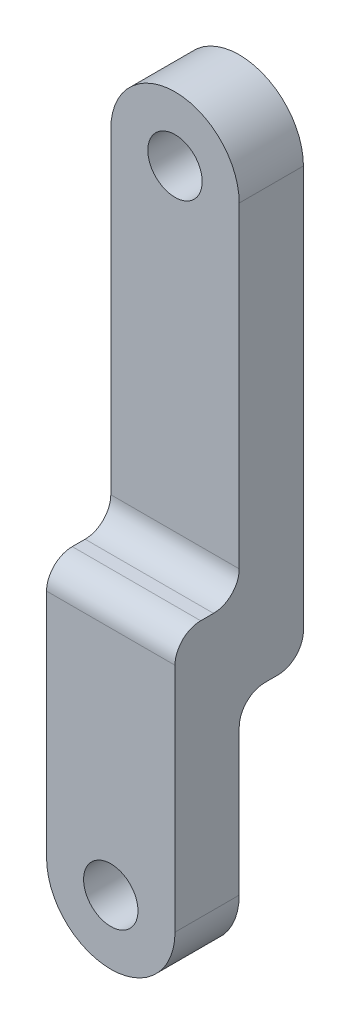
ISO-10303-21;
HEADER;
FILE_DESCRIPTION(('STEP AP214'),'2;1');
FILE_NAME('part.step','',(''),(''),'','','');
FILE_SCHEMA(('AUTOMOTIVE_DESIGN { 1 0 10303 214 1 1 1 1 }'));
ENDSEC;
DATA;
#1=APPLICATION_CONTEXT('core data for automotive mechanical design processes');
#2=APPLICATION_PROTOCOL_DEFINITION('international standard','automotive_design',2000,#1);
#3=PRODUCT_CONTEXT('',#1,'mechanical');
#4=PRODUCT('Part','Part','',(#3));
#5=PRODUCT_RELATED_PRODUCT_CATEGORY('part','',(#4));
#6=PRODUCT_DEFINITION_FORMATION('','',#4);
#7=PRODUCT_DEFINITION_CONTEXT('part definition',#1,'design');
#8=PRODUCT_DEFINITION('design','',#6,#7);
#9=PRODUCT_DEFINITION_SHAPE('','',#8);
#10=(LENGTH_UNIT() NAMED_UNIT(*) SI_UNIT(.MILLI.,.METRE.));
#11=(NAMED_UNIT(*) PLANE_ANGLE_UNIT() SI_UNIT($,.RADIAN.));
#12=(NAMED_UNIT(*) SI_UNIT($,.STERADIAN.) SOLID_ANGLE_UNIT());
#13=UNCERTAINTY_MEASURE_WITH_UNIT(LENGTH_MEASURE(1.E-05),#10,'distance_accuracy_value','');
#14=(GEOMETRIC_REPRESENTATION_CONTEXT(3) GLOBAL_UNCERTAINTY_ASSIGNED_CONTEXT((#13)) GLOBAL_UNIT_ASSIGNED_CONTEXT((#10,
#11,#12)) REPRESENTATION_CONTEXT('',''));
#15=CARTESIAN_POINT('',(0.,0.,0.));
#16=DIRECTION('',(0.,0.,1.));
#17=DIRECTION('',(1.,0.,0.));
#18=AXIS2_PLACEMENT_3D('',#15,#16,#17);
#19=CARTESIAN_POINT('',(0.,0.,15.));
#20=DIRECTION('',(0.,0.,-1.));
#21=DIRECTION('',(-1.,0.,0.));
#22=AXIS2_PLACEMENT_3D('',#19,#20,#21);
#23=CYLINDRICAL_SURFACE('',#22,7.5);
#24=CARTESIAN_POINT('',(0.,0.,7.5));
#25=DIRECTION('',(0.,0.,-1.));
#26=DIRECTION('',(-1.,0.,0.));
#27=AXIS2_PLACEMENT_3D('',#24,#25,#26);
#28=CIRCLE('',#27,7.5);
#29=CARTESIAN_POINT('',(7.5,0.,7.5));
#30=VERTEX_POINT('',#29);
#31=CARTESIAN_POINT('',(-7.5,0.,7.5));
#32=VERTEX_POINT('',#31);
#33=EDGE_CURVE('E120',#30,#32,#28,.T.);
#34=ORIENTED_EDGE('',*,*,#33,.F.);
#35=DIRECTION('',(0.,0.,-1.));
#36=VECTOR('',#35,1.);
#37=CARTESIAN_POINT('',(7.5,0.,15.));
#38=LINE('',#37,#36);
#39=CARTESIAN_POINT('',(7.5,0.,15.));
#40=VERTEX_POINT('',#39);
#41=EDGE_CURVE('E140',#40,#30,#38,.T.);
#42=ORIENTED_EDGE('',*,*,#41,.F.);
#43=CARTESIAN_POINT('',(0.,0.,15.));
#44=DIRECTION('',(0.,0.,1.));
#45=DIRECTION('',(1.,0.,0.));
#46=AXIS2_PLACEMENT_3D('',#43,#44,#45);
#47=CIRCLE('',#46,7.5);
#48=CARTESIAN_POINT('',(-7.5,0.,15.));
#49=VERTEX_POINT('',#48);
#50=EDGE_CURVE('E138',#49,#40,#47,.T.);
#51=ORIENTED_EDGE('',*,*,#50,.F.);
#52=DIRECTION('',(0.,0.,-1.));
#53=VECTOR('',#52,1.);
#54=CARTESIAN_POINT('',(-7.5,0.,15.));
#55=LINE('',#54,#53);
#56=EDGE_CURVE('E135',#49,#32,#55,.T.);
#57=ORIENTED_EDGE('',*,*,#56,.T.);
#58=EDGE_LOOP('',(#34,#42,#51,#57));
#59=FACE_BOUND('',#58,.T.);
#60=ADVANCED_FACE('F31',(#59),#23,.T.);
#61=CARTESIAN_POINT('',(0.,0.,15.));
#62=DIRECTION('',(0.,0.,-1.));
#63=DIRECTION('',(-1.,0.,0.));
#64=AXIS2_PLACEMENT_3D('',#61,#62,#63);
#65=CYLINDRICAL_SURFACE('',#64,3.175);
#66=CARTESIAN_POINT('',(0.,0.,15.));
#67=DIRECTION('',(0.,0.,1.));
#68=DIRECTION('',(1.,0.,0.));
#69=AXIS2_PLACEMENT_3D('',#66,#67,#68);
#70=CIRCLE('',#69,3.175);
#71=CARTESIAN_POINT('',(3.175,0.,15.));
#72=VERTEX_POINT('',#71);
#73=EDGE_CURVE('E151',#72,#72,#70,.T.);
#74=ORIENTED_EDGE('',*,*,#73,.T.);
#75=EDGE_LOOP('',(#74));
#76=FACE_BOUND('',#75,.T.);
#77=CARTESIAN_POINT('',(0.,0.,7.5));
#78=DIRECTION('',(0.,0.,-1.));
#79=DIRECTION('',(-1.,0.,0.));
#80=AXIS2_PLACEMENT_3D('',#77,#78,#79);
#81=CIRCLE('',#80,3.175);
#82=CARTESIAN_POINT('',(-3.175,0.,7.5));
#83=VERTEX_POINT('',#82);
#84=EDGE_CURVE('E153',#83,#83,#81,.T.);
#85=ORIENTED_EDGE('',*,*,#84,.T.);
#86=EDGE_LOOP('',(#85));
#87=FACE_BOUND('',#86,.T.);
#88=ADVANCED_FACE('F263',(#76,#87),#65,.F.);
#89=CARTESIAN_POINT('',(0.,70.,15.));
#90=DIRECTION('',(0.,0.,-1.));
#91=DIRECTION('',(-1.,0.,0.));
#92=AXIS2_PLACEMENT_3D('',#89,#90,#91);
#93=CYLINDRICAL_SURFACE('',#92,7.5);
#94=CARTESIAN_POINT('',(0.,70.,7.5));
#95=DIRECTION('',(0.,0.,1.));
#96=DIRECTION('',(1.,0.,0.));
#97=AXIS2_PLACEMENT_3D('',#94,#95,#96);
#98=CIRCLE('',#97,7.5);
#99=CARTESIAN_POINT('',(7.5,70.,7.5));
#100=VERTEX_POINT('',#99);
#101=CARTESIAN_POINT('',(-7.5,70.,7.5));
#102=VERTEX_POINT('',#101);
#103=EDGE_CURVE('E205',#100,#102,#98,.T.);
#104=ORIENTED_EDGE('',*,*,#103,.F.);
#105=DIRECTION('',(0.,0.,-1.));
#106=VECTOR('',#105,1.);
#107=CARTESIAN_POINT('',(7.5,70.,15.));
#108=LINE('',#107,#106);
#109=CARTESIAN_POINT('',(7.5,70.,0.));
#110=VERTEX_POINT('',#109);
#111=EDGE_CURVE('E144',#100,#110,#108,.T.);
#112=ORIENTED_EDGE('',*,*,#111,.T.);
#113=CARTESIAN_POINT('',(0.,70.,0.));
#114=DIRECTION('',(0.,0.,1.));
#115=DIRECTION('',(1.,0.,0.));
#116=AXIS2_PLACEMENT_3D('',#113,#114,#115);
#117=CIRCLE('',#116,7.5);
#118=CARTESIAN_POINT('',(-7.5,70.,0.));
#119=VERTEX_POINT('',#118);
#120=EDGE_CURVE('E220',#110,#119,#117,.T.);
#121=ORIENTED_EDGE('',*,*,#120,.T.);
#122=DIRECTION('',(0.,0.,-1.));
#123=VECTOR('',#122,1.);
#124=CARTESIAN_POINT('',(-7.5,70.,15.));
#125=LINE('',#124,#123);
#126=EDGE_CURVE('E139',#102,#119,#125,.T.);
#127=ORIENTED_EDGE('',*,*,#126,.F.);
#128=EDGE_LOOP('',(#104,#112,#121,#127));
#129=FACE_BOUND('',#128,.T.);
#130=ADVANCED_FACE('F236',(#129),#93,.T.);
#131=CARTESIAN_POINT('',(0.,70.,15.));
#132=DIRECTION('',(0.,0.,-1.));
#133=DIRECTION('',(-1.,0.,0.));
#134=AXIS2_PLACEMENT_3D('',#131,#132,#133);
#135=CYLINDRICAL_SURFACE('',#134,3.175);
#136=CARTESIAN_POINT('',(0.,70.,0.));
#137=DIRECTION('',(0.,0.,1.));
#138=DIRECTION('',(1.,0.,0.));
#139=AXIS2_PLACEMENT_3D('',#136,#137,#138);
#140=CIRCLE('',#139,3.175);
#141=CARTESIAN_POINT('',(3.175,70.,0.));
#142=VERTEX_POINT('',#141);
#143=EDGE_CURVE('E217',#142,#142,#140,.T.);
#144=ORIENTED_EDGE('',*,*,#143,.F.);
#145=EDGE_LOOP('',(#144));
#146=FACE_BOUND('',#145,.T.);
#147=CARTESIAN_POINT('',(0.,70.,7.5));
#148=DIRECTION('',(0.,0.,1.));
#149=DIRECTION('',(1.,0.,0.));
#150=AXIS2_PLACEMENT_3D('',#147,#148,#149);
#151=CIRCLE('',#150,3.175);
#152=CARTESIAN_POINT('',(3.175,70.,7.5));
#153=VERTEX_POINT('',#152);
#154=EDGE_CURVE('E148',#153,#153,#151,.T.);
#155=ORIENTED_EDGE('',*,*,#154,.T.);
#156=EDGE_LOOP('',(#155));
#157=FACE_BOUND('',#156,.T.);
#158=ADVANCED_FACE('F277',(#146,#157),#135,.F.);
#159=CARTESIAN_POINT('',(0.,70.,15.));
#160=DIRECTION('',(0.,0.,1.));
#161=DIRECTION('',(1.,0.,0.));
#162=AXIS2_PLACEMENT_3D('',#159,#160,#161);
#163=PLANE('',#162);
#164=DIRECTION('',(0.,1.,0.));
#165=VECTOR('',#164,1.);
#166=CARTESIAN_POINT('',(7.5,70.,15.));
#167=LINE('',#166,#165);
#168=CARTESIAN_POINT('',(7.5,27.,15.));
#169=VERTEX_POINT('',#168);
#170=EDGE_CURVE('E225',#40,#169,#167,.T.);
#171=ORIENTED_EDGE('',*,*,#170,.T.);
#172=DIRECTION('',(1.,0.,0.));
#173=VECTOR('',#172,1.);
#174=CARTESIAN_POINT('',(-7.49999999999999,27.,15.));
#175=LINE('',#174,#173);
#176=CARTESIAN_POINT('',(-7.5,27.,15.));
#177=VERTEX_POINT('',#176);
#178=EDGE_CURVE('E166',#169,#177,#175,.F.);
#179=ORIENTED_EDGE('',*,*,#178,.T.);
#180=DIRECTION('',(0.,-1.,0.));
#181=VECTOR('',#180,1.);
#182=CARTESIAN_POINT('',(-7.5,0.,15.));
#183=LINE('',#182,#181);
#184=EDGE_CURVE('E221',#177,#49,#183,.T.);
#185=ORIENTED_EDGE('',*,*,#184,.T.);
#186=ORIENTED_EDGE('',*,*,#50,.T.);
#187=EDGE_LOOP('',(#171,#179,#185,#186));
#188=FACE_BOUND('',#187,.T.);
#189=ORIENTED_EDGE('',*,*,#73,.F.);
#190=EDGE_LOOP('',(#189));
#191=FACE_BOUND('',#190,.T.);
#192=ADVANCED_FACE('F288',(#188,#191),#163,.T.);
#193=CARTESIAN_POINT('',(0.,70.,0.));
#194=DIRECTION('',(0.,0.,1.));
#195=DIRECTION('',(1.,0.,0.));
#196=AXIS2_PLACEMENT_3D('',#193,#194,#195);
#197=PLANE('',#196);
#198=ORIENTED_EDGE('',*,*,#143,.T.);
#199=EDGE_LOOP('',(#198));
#200=FACE_BOUND('',#199,.T.);
#201=DIRECTION('',(0.,1.,0.));
#202=VECTOR('',#201,1.);
#203=CARTESIAN_POINT('',(7.5,70.,0.));
#204=LINE('',#203,#202);
#205=CARTESIAN_POINT('',(7.5,23.,0.));
#206=VERTEX_POINT('',#205);
#207=EDGE_CURVE('E223',#206,#110,#204,.T.);
#208=ORIENTED_EDGE('',*,*,#207,.F.);
#209=DIRECTION('',(1.,0.,0.));
#210=VECTOR('',#209,1.);
#211=CARTESIAN_POINT('',(0.,23.,0.));
#212=LINE('',#211,#210);
#213=CARTESIAN_POINT('',(-7.5,23.,0.));
#214=VERTEX_POINT('',#213);
#215=EDGE_CURVE('E177',#206,#214,#212,.F.);
#216=ORIENTED_EDGE('',*,*,#215,.T.);
#217=DIRECTION('',(0.,-1.,0.));
#218=VECTOR('',#217,1.);
#219=CARTESIAN_POINT('',(-7.5,0.,0.));
#220=LINE('',#219,#218);
#221=EDGE_CURVE('E230',#119,#214,#220,.T.);
#222=ORIENTED_EDGE('',*,*,#221,.F.);
#223=ORIENTED_EDGE('',*,*,#120,.F.);
#224=EDGE_LOOP('',(#208,#216,#222,#223));
#225=FACE_BOUND('',#224,.T.);
#226=ADVANCED_FACE('F240',(#200,#225),#197,.F.);
#227=CARTESIAN_POINT('',(-7.5,0.,15.));
#228=DIRECTION('',(1.,0.,0.));
#229=DIRECTION('',(0.,0.,-1.));
#230=AXIS2_PLACEMENT_3D('',#227,#228,#229);
#231=PLANE('',#230);
#232=ORIENTED_EDGE('',*,*,#184,.F.);
#233=CARTESIAN_POINT('',(-7.5,27.,12.));
#234=DIRECTION('',(1.,0.,0.));
#235=DIRECTION('',(0.,0.,-1.));
#236=AXIS2_PLACEMENT_3D('',#233,#234,#235);
#237=CIRCLE('',#236,3.);
#238=CARTESIAN_POINT('',(-7.49999999999999,30.,12.));
#239=VERTEX_POINT('',#238);
#240=EDGE_CURVE('E170',#177,#239,#237,.F.);
#241=ORIENTED_EDGE('',*,*,#240,.T.);
#242=DIRECTION('',(0.,0.,1.));
#243=VECTOR('',#242,1.);
#244=CARTESIAN_POINT('',(-7.49999999999999,30.,7.5));
#245=LINE('',#244,#243);
#246=CARTESIAN_POINT('',(-7.49999999999999,30.,10.5));
#247=VERTEX_POINT('',#246);
#248=EDGE_CURVE('E200',#247,#239,#245,.T.);
#249=ORIENTED_EDGE('',*,*,#248,.F.);
#250=CARTESIAN_POINT('',(-7.5,33.,10.5));
#251=DIRECTION('',(1.,0.,0.));
#252=DIRECTION('',(0.,0.,-1.));
#253=AXIS2_PLACEMENT_3D('',#250,#251,#252);
#254=CIRCLE('',#253,3.);
#255=CARTESIAN_POINT('',(-7.49999999999999,33.,7.5));
#256=VERTEX_POINT('',#255);
#257=EDGE_CURVE('E11',#247,#256,#254,.T.);
#258=ORIENTED_EDGE('',*,*,#257,.T.);
#259=DIRECTION('',(0.,-1.,0.));
#260=VECTOR('',#259,1.);
#261=CARTESIAN_POINT('',(-7.5,70.,7.5));
#262=LINE('',#261,#260);
#263=EDGE_CURVE('E156',#102,#256,#262,.T.);
#264=ORIENTED_EDGE('',*,*,#263,.F.);
#265=ORIENTED_EDGE('',*,*,#126,.T.);
#266=ORIENTED_EDGE('',*,*,#221,.T.);
#267=CARTESIAN_POINT('',(-7.5,23.,3.));
#268=DIRECTION('',(1.,0.,0.));
#269=DIRECTION('',(0.,0.,-1.));
#270=AXIS2_PLACEMENT_3D('',#267,#268,#269);
#271=CIRCLE('',#270,3.);
#272=CARTESIAN_POINT('',(-7.5,20.,3.));
#273=VERTEX_POINT('',#272);
#274=EDGE_CURVE('E168',#214,#273,#271,.F.);
#275=ORIENTED_EDGE('',*,*,#274,.T.);
#276=DIRECTION('',(0.,0.,-1.));
#277=VECTOR('',#276,1.);
#278=CARTESIAN_POINT('',(-7.5,20.,7.5));
#279=LINE('',#278,#277);
#280=CARTESIAN_POINT('',(-7.5,20.,4.5));
#281=VERTEX_POINT('',#280);
#282=EDGE_CURVE('E210',#281,#273,#279,.T.);
#283=ORIENTED_EDGE('',*,*,#282,.F.);
#284=CARTESIAN_POINT('',(-7.5,17.,4.5));
#285=DIRECTION('',(1.,0.,0.));
#286=DIRECTION('',(0.,0.,-1.));
#287=AXIS2_PLACEMENT_3D('',#284,#285,#286);
#288=CIRCLE('',#287,3.);
#289=CARTESIAN_POINT('',(-7.5,17.,7.5));
#290=VERTEX_POINT('',#289);
#291=EDGE_CURVE('E51',#281,#290,#288,.T.);
#292=ORIENTED_EDGE('',*,*,#291,.T.);
#293=DIRECTION('',(0.,1.,0.));
#294=VECTOR('',#293,1.);
#295=CARTESIAN_POINT('',(-7.5,20.,7.5));
#296=LINE('',#295,#294);
#297=EDGE_CURVE('E123',#32,#290,#296,.T.);
#298=ORIENTED_EDGE('',*,*,#297,.F.);
#299=ORIENTED_EDGE('',*,*,#56,.F.);
#300=EDGE_LOOP('',(#232,#241,#249,#258,#264,#265,#266,#275,#283,#292,#298,#299));
#301=FACE_BOUND('',#300,.T.);
#302=ADVANCED_FACE('F134',(#301),#231,.F.);
#303=CARTESIAN_POINT('',(7.5,70.,15.));
#304=DIRECTION('',(-1.,0.,0.));
#305=DIRECTION('',(0.,0.,1.));
#306=AXIS2_PLACEMENT_3D('',#303,#304,#305);
#307=PLANE('',#306);
#308=DIRECTION('',(0.,0.,1.));
#309=VECTOR('',#308,1.);
#310=CARTESIAN_POINT('',(7.5,30.,7.5));
#311=LINE('',#310,#309);
#312=CARTESIAN_POINT('',(7.5,30.,10.5));
#313=VERTEX_POINT('',#312);
#314=CARTESIAN_POINT('',(7.5,30.,12.));
#315=VERTEX_POINT('',#314);
#316=EDGE_CURVE('E152',#313,#315,#311,.T.);
#317=ORIENTED_EDGE('',*,*,#316,.T.);
#318=CARTESIAN_POINT('',(7.5,27.,12.));
#319=DIRECTION('',(-1.,0.,0.));
#320=DIRECTION('',(0.,0.,1.));
#321=AXIS2_PLACEMENT_3D('',#318,#319,#320);
#322=CIRCLE('',#321,3.);
#323=EDGE_CURVE('E164',#315,#169,#322,.F.);
#324=ORIENTED_EDGE('',*,*,#323,.T.);
#325=ORIENTED_EDGE('',*,*,#170,.F.);
#326=ORIENTED_EDGE('',*,*,#41,.T.);
#327=DIRECTION('',(0.,-1.,0.));
#328=VECTOR('',#327,1.);
#329=CARTESIAN_POINT('',(7.5,0.,7.5));
#330=LINE('',#329,#328);
#331=CARTESIAN_POINT('',(7.5,17.,7.5));
#332=VERTEX_POINT('',#331);
#333=EDGE_CURVE('E126',#332,#30,#330,.T.);
#334=ORIENTED_EDGE('',*,*,#333,.F.);
#335=CARTESIAN_POINT('',(7.5,17.,4.5));
#336=DIRECTION('',(-1.,0.,0.));
#337=DIRECTION('',(0.,0.,1.));
#338=AXIS2_PLACEMENT_3D('',#335,#336,#337);
#339=CIRCLE('',#338,3.);
#340=CARTESIAN_POINT('',(7.5,20.,4.5));
#341=VERTEX_POINT('',#340);
#342=EDGE_CURVE('E184',#332,#341,#339,.T.);
#343=ORIENTED_EDGE('',*,*,#342,.T.);
#344=DIRECTION('',(0.,0.,-1.));
#345=VECTOR('',#344,1.);
#346=CARTESIAN_POINT('',(7.5,20.,7.5));
#347=LINE('',#346,#345);
#348=CARTESIAN_POINT('',(7.5,20.,3.));
#349=VERTEX_POINT('',#348);
#350=EDGE_CURVE('E157',#341,#349,#347,.T.);
#351=ORIENTED_EDGE('',*,*,#350,.T.);
#352=CARTESIAN_POINT('',(7.5,23.,3.));
#353=DIRECTION('',(-1.,0.,0.));
#354=DIRECTION('',(0.,0.,1.));
#355=AXIS2_PLACEMENT_3D('',#352,#353,#354);
#356=CIRCLE('',#355,3.);
#357=EDGE_CURVE('E162',#349,#206,#356,.F.);
#358=ORIENTED_EDGE('',*,*,#357,.T.);
#359=ORIENTED_EDGE('',*,*,#207,.T.);
#360=ORIENTED_EDGE('',*,*,#111,.F.);
#361=DIRECTION('',(0.,1.,0.));
#362=VECTOR('',#361,1.);
#363=CARTESIAN_POINT('',(7.5,30.,7.5));
#364=LINE('',#363,#362);
#365=CARTESIAN_POINT('',(7.5,33.,7.5));
#366=VERTEX_POINT('',#365);
#367=EDGE_CURVE('E192',#366,#100,#364,.T.);
#368=ORIENTED_EDGE('',*,*,#367,.F.);
#369=CARTESIAN_POINT('',(7.5,33.,10.5));
#370=DIRECTION('',(-1.,0.,0.));
#371=DIRECTION('',(0.,0.,1.));
#372=AXIS2_PLACEMENT_3D('',#369,#370,#371);
#373=CIRCLE('',#372,3.);
#374=EDGE_CURVE('E39',#366,#313,#373,.T.);
#375=ORIENTED_EDGE('',*,*,#374,.T.);
#376=EDGE_LOOP('',(#317,#324,#325,#326,#334,#343,#351,#358,#359,#360,#368,#375));
#377=FACE_BOUND('',#376,.T.);
#378=ADVANCED_FACE('F190',(#377),#307,.F.);
#379=CARTESIAN_POINT('',(-7.49999999999999,30.,7.5));
#380=DIRECTION('',(0.,-1.,0.));
#381=DIRECTION('',(0.,0.,-1.));
#382=AXIS2_PLACEMENT_3D('',#379,#380,#381);
#383=PLANE('',#382);
#384=ORIENTED_EDGE('',*,*,#248,.T.);
#385=DIRECTION('',(1.,0.,0.));
#386=VECTOR('',#385,1.);
#387=CARTESIAN_POINT('',(7.5,30.,12.));
#388=LINE('',#387,#386);
#389=EDGE_CURVE('E159',#239,#315,#388,.T.);
#390=ORIENTED_EDGE('',*,*,#389,.T.);
#391=ORIENTED_EDGE('',*,*,#316,.F.);
#392=DIRECTION('',(1.,0.,0.));
#393=VECTOR('',#392,1.);
#394=CARTESIAN_POINT('',(-7.49999999999999,30.,10.5));
#395=LINE('',#394,#393);
#396=EDGE_CURVE('E142',#313,#247,#395,.F.);
#397=ORIENTED_EDGE('',*,*,#396,.T.);
#398=EDGE_LOOP('',(#384,#390,#391,#397));
#399=FACE_BOUND('',#398,.T.);
#400=ADVANCED_FACE('F198',(#399),#383,.F.);
#401=CARTESIAN_POINT('',(0.,70.,7.5));
#402=DIRECTION('',(0.,0.,1.));
#403=DIRECTION('',(1.,0.,0.));
#404=AXIS2_PLACEMENT_3D('',#401,#402,#403);
#405=PLANE('',#404);
#406=ORIENTED_EDGE('',*,*,#154,.F.);
#407=EDGE_LOOP('',(#406));
#408=FACE_BOUND('',#407,.T.);
#409=ORIENTED_EDGE('',*,*,#263,.T.);
#410=DIRECTION('',(1.,0.,0.));
#411=VECTOR('',#410,1.);
#412=CARTESIAN_POINT('',(0.,33.,7.5));
#413=LINE('',#412,#411);
#414=EDGE_CURVE('E181',#256,#366,#413,.T.);
#415=ORIENTED_EDGE('',*,*,#414,.T.);
#416=ORIENTED_EDGE('',*,*,#367,.T.);
#417=ORIENTED_EDGE('',*,*,#103,.T.);
#418=EDGE_LOOP('',(#409,#415,#416,#417));
#419=FACE_BOUND('',#418,.T.);
#420=ADVANCED_FACE('F203',(#408,#419),#405,.T.);
#421=CARTESIAN_POINT('',(7.5,20.,7.5));
#422=DIRECTION('',(0.,1.,0.));
#423=DIRECTION('',(0.,0.,1.));
#424=AXIS2_PLACEMENT_3D('',#421,#422,#423);
#425=PLANE('',#424);
#426=ORIENTED_EDGE('',*,*,#282,.T.);
#427=DIRECTION('',(1.,0.,0.));
#428=VECTOR('',#427,1.);
#429=CARTESIAN_POINT('',(7.5,20.,3.));
#430=LINE('',#429,#428);
#431=EDGE_CURVE('E174',#273,#349,#430,.T.);
#432=ORIENTED_EDGE('',*,*,#431,.T.);
#433=ORIENTED_EDGE('',*,*,#350,.F.);
#434=DIRECTION('',(1.,0.,0.));
#435=VECTOR('',#434,1.);
#436=CARTESIAN_POINT('',(7.5,20.,4.5));
#437=LINE('',#436,#435);
#438=EDGE_CURVE('E172',#341,#281,#437,.F.);
#439=ORIENTED_EDGE('',*,*,#438,.T.);
#440=EDGE_LOOP('',(#426,#432,#433,#439));
#441=FACE_BOUND('',#440,.T.);
#442=ADVANCED_FACE('F250',(#441),#425,.F.);
#443=CARTESIAN_POINT('',(0.,0.,7.5));
#444=DIRECTION('',(0.,0.,-1.));
#445=DIRECTION('',(-1.,0.,0.));
#446=AXIS2_PLACEMENT_3D('',#443,#444,#445);
#447=PLANE('',#446);
#448=ORIENTED_EDGE('',*,*,#84,.F.);
#449=EDGE_LOOP('',(#448));
#450=FACE_BOUND('',#449,.T.);
#451=ORIENTED_EDGE('',*,*,#297,.T.);
#452=DIRECTION('',(1.,0.,0.));
#453=VECTOR('',#452,1.);
#454=CARTESIAN_POINT('',(0.,17.,7.5));
#455=LINE('',#454,#453);
#456=EDGE_CURVE('E179',#290,#332,#455,.T.);
#457=ORIENTED_EDGE('',*,*,#456,.T.);
#458=ORIENTED_EDGE('',*,*,#333,.T.);
#459=ORIENTED_EDGE('',*,*,#33,.T.);
#460=EDGE_LOOP('',(#451,#457,#458,#459));
#461=FACE_BOUND('',#460,.T.);
#462=ADVANCED_FACE('F121',(#450,#461),#447,.T.);
#463=CARTESIAN_POINT('',(-7.49999999999999,27.,12.));
#464=DIRECTION('',(-1.,0.,0.));
#465=DIRECTION('',(0.,0.,1.));
#466=AXIS2_PLACEMENT_3D('',#463,#464,#465);
#467=CYLINDRICAL_SURFACE('',#466,3.);
#468=ORIENTED_EDGE('',*,*,#240,.F.);
#469=ORIENTED_EDGE('',*,*,#178,.F.);
#470=ORIENTED_EDGE('',*,*,#323,.F.);
#471=ORIENTED_EDGE('',*,*,#389,.F.);
#472=EDGE_LOOP('',(#468,#469,#470,#471));
#473=FACE_BOUND('',#472,.T.);
#474=ADVANCED_FACE('F260',(#473),#467,.T.);
#475=CARTESIAN_POINT('',(7.5,23.,3.));
#476=DIRECTION('',(1.,0.,0.));
#477=DIRECTION('',(0.,0.,-1.));
#478=AXIS2_PLACEMENT_3D('',#475,#476,#477);
#479=CYLINDRICAL_SURFACE('',#478,3.);
#480=ORIENTED_EDGE('',*,*,#274,.F.);
#481=ORIENTED_EDGE('',*,*,#215,.F.);
#482=ORIENTED_EDGE('',*,*,#357,.F.);
#483=ORIENTED_EDGE('',*,*,#431,.F.);
#484=EDGE_LOOP('',(#480,#481,#482,#483));
#485=FACE_BOUND('',#484,.T.);
#486=ADVANCED_FACE('F246',(#485),#479,.T.);
#487=CARTESIAN_POINT('',(0.,17.,4.5));
#488=DIRECTION('',(1.,0.,0.));
#489=DIRECTION('',(0.,0.,-1.));
#490=AXIS2_PLACEMENT_3D('',#487,#488,#489);
#491=CYLINDRICAL_SURFACE('',#490,3.);
#492=ORIENTED_EDGE('',*,*,#291,.F.);
#493=ORIENTED_EDGE('',*,*,#438,.F.);
#494=ORIENTED_EDGE('',*,*,#342,.F.);
#495=ORIENTED_EDGE('',*,*,#456,.F.);
#496=EDGE_LOOP('',(#492,#493,#494,#495));
#497=FACE_BOUND('',#496,.T.);
#498=ADVANCED_FACE('F254',(#497),#491,.F.);
#499=CARTESIAN_POINT('',(0.,33.,10.5));
#500=DIRECTION('',(1.,0.,0.));
#501=DIRECTION('',(0.,0.,-1.));
#502=AXIS2_PLACEMENT_3D('',#499,#500,#501);
#503=CYLINDRICAL_SURFACE('',#502,3.);
#504=ORIENTED_EDGE('',*,*,#257,.F.);
#505=ORIENTED_EDGE('',*,*,#396,.F.);
#506=ORIENTED_EDGE('',*,*,#374,.F.);
#507=ORIENTED_EDGE('',*,*,#414,.F.);
#508=EDGE_LOOP('',(#504,#505,#506,#507));
#509=FACE_BOUND('',#508,.T.);
#510=ADVANCED_FACE('F33',(#509),#503,.F.);
#511=CLOSED_SHELL('',(#60,#88,#130,#158,#192,#226,#302,#378,#400,#420,#442,#462,#474,#486,#498,#510));
#512=MANIFOLD_SOLID_BREP('B2',#511);
#513=ADVANCED_BREP_SHAPE_REPRESENTATION('',(#18,#512),#14);
#514=SHAPE_DEFINITION_REPRESENTATION(#9,#513);
ENDSEC;
END-ISO-10303-21;
